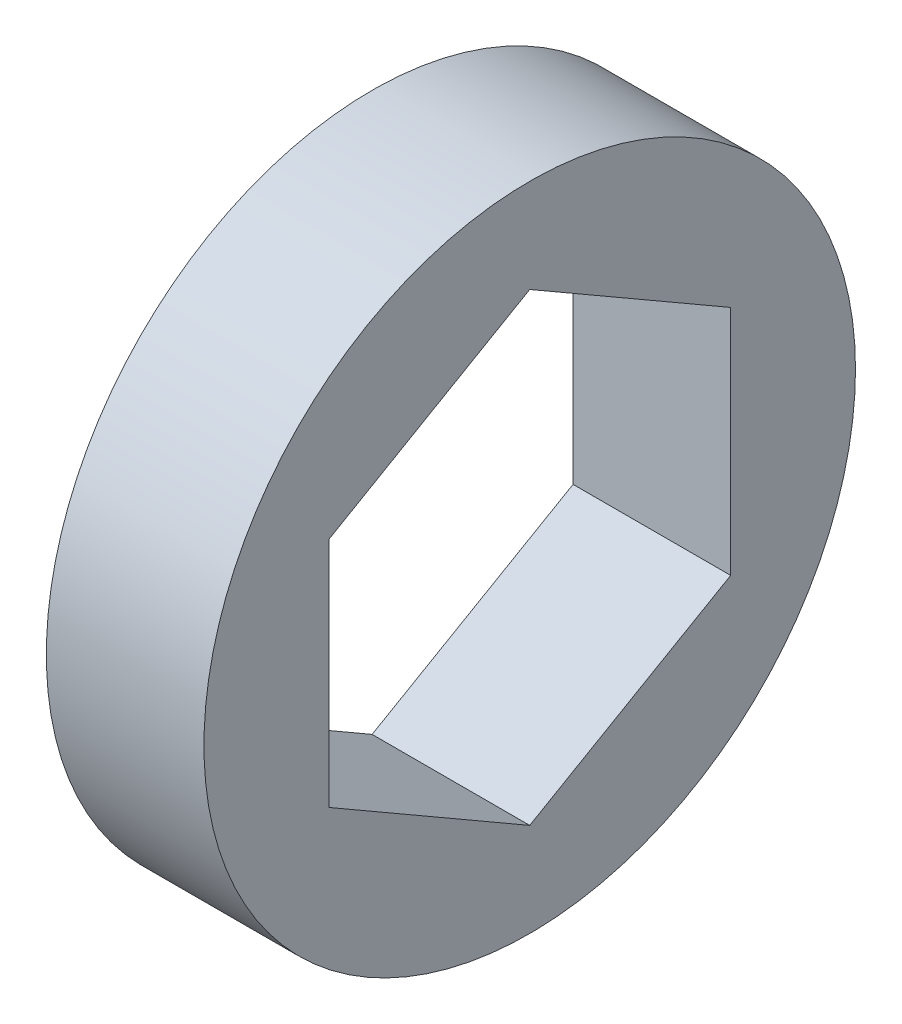
ISO-10303-21;
HEADER;
FILE_DESCRIPTION(('STEP AP214'),'2;1');
FILE_NAME('part.step','',(''),(''),'','','');
FILE_SCHEMA(('AUTOMOTIVE_DESIGN { 1 0 10303 214 1 1 1 1 }'));
ENDSEC;
DATA;
#1=APPLICATION_CONTEXT('core data for automotive mechanical design processes');
#2=APPLICATION_PROTOCOL_DEFINITION('international standard','automotive_design',2000,#1);
#3=PRODUCT_CONTEXT('',#1,'mechanical');
#4=PRODUCT('Part','Part','',(#3));
#5=PRODUCT_RELATED_PRODUCT_CATEGORY('part','',(#4));
#6=PRODUCT_DEFINITION_FORMATION('','',#4);
#7=PRODUCT_DEFINITION_CONTEXT('part definition',#1,'design');
#8=PRODUCT_DEFINITION('design','',#6,#7);
#9=PRODUCT_DEFINITION_SHAPE('','',#8);
#10=(LENGTH_UNIT() NAMED_UNIT(*) SI_UNIT(.MILLI.,.METRE.));
#11=(NAMED_UNIT(*) PLANE_ANGLE_UNIT() SI_UNIT($,.RADIAN.));
#12=(NAMED_UNIT(*) SI_UNIT($,.STERADIAN.) SOLID_ANGLE_UNIT());
#13=UNCERTAINTY_MEASURE_WITH_UNIT(LENGTH_MEASURE(1.E-05),#10,'distance_accuracy_value','');
#14=(GEOMETRIC_REPRESENTATION_CONTEXT(3) GLOBAL_UNCERTAINTY_ASSIGNED_CONTEXT((#13)) GLOBAL_UNIT_ASSIGNED_CONTEXT((#10,
#11,#12)) REPRESENTATION_CONTEXT('',''));
#15=CARTESIAN_POINT('',(0.,0.,0.));
#16=DIRECTION('',(0.,0.,1.));
#17=DIRECTION('',(1.,0.,0.));
#18=AXIS2_PLACEMENT_3D('',#15,#16,#17);
#19=CARTESIAN_POINT('',(5.08,0.,0.));
#20=DIRECTION('',(1.,0.,0.));
#21=DIRECTION('',(0.,0.,-1.));
#22=AXIS2_PLACEMENT_3D('',#19,#20,#21);
#23=PLANE('',#22);
#24=CARTESIAN_POINT('',(5.08,0.,0.));
#25=DIRECTION('',(1.,0.,0.));
#26=DIRECTION('',(0.,0.,-1.));
#27=AXIS2_PLACEMENT_3D('',#24,#25,#26);
#28=CIRCLE('',#27,10.5);
#29=CARTESIAN_POINT('',(5.08,0.,-10.5));
#30=VERTEX_POINT('',#29);
#31=EDGE_CURVE('E11',#30,#30,#28,.T.);
#32=ORIENTED_EDGE('',*,*,#31,.T.);
#33=EDGE_LOOP('',(#32));
#34=FACE_BOUND('',#33,.T.);
#35=DIRECTION('',(0.,-0.5,0.866025403784439));
#36=VECTOR('',#35,1.);
#37=CARTESIAN_POINT('',(5.08,7.47899538708242,0.));
#38=LINE('',#37,#36);
#39=CARTESIAN_POINT('',(5.08,7.47899538708242,0.));
#40=VERTEX_POINT('',#39);
#41=CARTESIAN_POINT('',(5.08,3.73949769354121,6.477));
#42=VERTEX_POINT('',#41);
#43=EDGE_CURVE('E94',#40,#42,#38,.T.);
#44=ORIENTED_EDGE('',*,*,#43,.F.);
#45=DIRECTION('',(0.,0.5,0.866025403784439));
#46=VECTOR('',#45,1.);
#47=CARTESIAN_POINT('',(5.08,3.73949769354121,-6.477));
#48=LINE('',#47,#46);
#49=CARTESIAN_POINT('',(5.08,3.73949769354121,-6.477));
#50=VERTEX_POINT('',#49);
#51=EDGE_CURVE('E86',#50,#40,#48,.T.);
#52=ORIENTED_EDGE('',*,*,#51,.F.);
#53=DIRECTION('',(0.,1.,0.));
#54=VECTOR('',#53,1.);
#55=CARTESIAN_POINT('',(5.08,-3.73949769354121,-6.477));
#56=LINE('',#55,#54);
#57=CARTESIAN_POINT('',(5.08,-3.73949769354121,-6.477));
#58=VERTEX_POINT('',#57);
#59=EDGE_CURVE('E114',#58,#50,#56,.T.);
#60=ORIENTED_EDGE('',*,*,#59,.F.);
#61=DIRECTION('',(0.,0.5,-0.866025403784439));
#62=VECTOR('',#61,1.);
#63=CARTESIAN_POINT('',(5.08,-7.47899538708241,0.));
#64=LINE('',#63,#62);
#65=CARTESIAN_POINT('',(5.08,-7.47899538708241,0.));
#66=VERTEX_POINT('',#65);
#67=EDGE_CURVE('E112',#66,#58,#64,.T.);
#68=ORIENTED_EDGE('',*,*,#67,.F.);
#69=DIRECTION('',(0.,-0.5,-0.866025403784439));
#70=VECTOR('',#69,1.);
#71=CARTESIAN_POINT('',(5.08,-3.7394976935412,6.477));
#72=LINE('',#71,#70);
#73=CARTESIAN_POINT('',(5.08,-3.7394976935412,6.477));
#74=VERTEX_POINT('',#73);
#75=EDGE_CURVE('E108',#74,#66,#72,.T.);
#76=ORIENTED_EDGE('',*,*,#75,.F.);
#77=DIRECTION('',(0.,-1.,0.));
#78=VECTOR('',#77,1.);
#79=CARTESIAN_POINT('',(5.08,3.73949769354121,6.477));
#80=LINE('',#79,#78);
#81=EDGE_CURVE('E106',#42,#74,#80,.T.);
#82=ORIENTED_EDGE('',*,*,#81,.F.);
#83=EDGE_LOOP('',(#44,#52,#60,#68,#76,#82));
#84=FACE_BOUND('',#83,.T.);
#85=ADVANCED_FACE('F33',(#34,#84),#23,.T.);
#86=CARTESIAN_POINT('',(0.,0.,0.));
#87=DIRECTION('',(1.,0.,0.));
#88=DIRECTION('',(0.,0.,-1.));
#89=AXIS2_PLACEMENT_3D('',#86,#87,#88);
#90=PLANE('',#89);
#91=CARTESIAN_POINT('',(0.,0.,0.));
#92=DIRECTION('',(1.,0.,0.));
#93=DIRECTION('',(0.,0.,-1.));
#94=AXIS2_PLACEMENT_3D('',#91,#92,#93);
#95=CIRCLE('',#94,10.5);
#96=CARTESIAN_POINT('',(0.,0.,-10.5));
#97=VERTEX_POINT('',#96);
#98=EDGE_CURVE('E37',#97,#97,#95,.T.);
#99=ORIENTED_EDGE('',*,*,#98,.F.);
#100=EDGE_LOOP('',(#99));
#101=FACE_BOUND('',#100,.T.);
#102=DIRECTION('',(0.,0.5,0.866025403784439));
#103=VECTOR('',#102,1.);
#104=CARTESIAN_POINT('',(0.,3.73949769354121,-6.477));
#105=LINE('',#104,#103);
#106=CARTESIAN_POINT('',(0.,3.73949769354121,-6.477));
#107=VERTEX_POINT('',#106);
#108=CARTESIAN_POINT('',(0.,7.47899538708242,0.));
#109=VERTEX_POINT('',#108);
#110=EDGE_CURVE('E56',#107,#109,#105,.T.);
#111=ORIENTED_EDGE('',*,*,#110,.T.);
#112=DIRECTION('',(0.,-0.5,0.866025403784439));
#113=VECTOR('',#112,1.);
#114=CARTESIAN_POINT('',(0.,7.47899538708242,0.));
#115=LINE('',#114,#113);
#116=CARTESIAN_POINT('',(0.,3.73949769354121,6.477));
#117=VERTEX_POINT('',#116);
#118=EDGE_CURVE('E101',#109,#117,#115,.T.);
#119=ORIENTED_EDGE('',*,*,#118,.T.);
#120=DIRECTION('',(0.,-1.,0.));
#121=VECTOR('',#120,1.);
#122=CARTESIAN_POINT('',(0.,3.73949769354121,6.477));
#123=LINE('',#122,#121);
#124=CARTESIAN_POINT('',(0.,-3.7394976935412,6.477));
#125=VERTEX_POINT('',#124);
#126=EDGE_CURVE('E118',#117,#125,#123,.T.);
#127=ORIENTED_EDGE('',*,*,#126,.T.);
#128=DIRECTION('',(0.,-0.5,-0.866025403784439));
#129=VECTOR('',#128,1.);
#130=CARTESIAN_POINT('',(0.,-3.7394976935412,6.477));
#131=LINE('',#130,#129);
#132=CARTESIAN_POINT('',(0.,-7.47899538708241,0.));
#133=VERTEX_POINT('',#132);
#134=EDGE_CURVE('E121',#125,#133,#131,.T.);
#135=ORIENTED_EDGE('',*,*,#134,.T.);
#136=DIRECTION('',(0.,0.5,-0.866025403784439));
#137=VECTOR('',#136,1.);
#138=CARTESIAN_POINT('',(0.,-7.47899538708241,0.));
#139=LINE('',#138,#137);
#140=CARTESIAN_POINT('',(0.,-3.73949769354121,-6.477));
#141=VERTEX_POINT('',#140);
#142=EDGE_CURVE('E124',#133,#141,#139,.T.);
#143=ORIENTED_EDGE('',*,*,#142,.T.);
#144=DIRECTION('',(0.,1.,0.));
#145=VECTOR('',#144,1.);
#146=CARTESIAN_POINT('',(0.,-3.73949769354121,-6.477));
#147=LINE('',#146,#145);
#148=EDGE_CURVE('E95',#141,#107,#147,.T.);
#149=ORIENTED_EDGE('',*,*,#148,.T.);
#150=EDGE_LOOP('',(#111,#119,#127,#135,#143,#149));
#151=FACE_BOUND('',#150,.T.);
#152=ADVANCED_FACE('F141',(#101,#151),#90,.F.);
#153=CARTESIAN_POINT('',(5.08,0.,0.));
#154=DIRECTION('',(-1.,0.,0.));
#155=DIRECTION('',(0.,0.,1.));
#156=AXIS2_PLACEMENT_3D('',#153,#154,#155);
#157=CYLINDRICAL_SURFACE('',#156,10.5);
#158=ORIENTED_EDGE('',*,*,#31,.F.);
#159=EDGE_LOOP('',(#158));
#160=FACE_BOUND('',#159,.T.);
#161=ORIENTED_EDGE('',*,*,#98,.T.);
#162=EDGE_LOOP('',(#161));
#163=FACE_BOUND('',#162,.T.);
#164=ADVANCED_FACE('F35',(#160,#163),#157,.T.);
#165=CARTESIAN_POINT('',(5.08,3.73949769354121,-6.477));
#166=DIRECTION('',(0.,-0.866025403784439,0.5));
#167=DIRECTION('',(0.,-0.5,-0.866025403784439));
#168=AXIS2_PLACEMENT_3D('',#165,#166,#167);
#169=PLANE('',#168);
#170=ORIENTED_EDGE('',*,*,#110,.F.);
#171=DIRECTION('',(-1.,0.,0.));
#172=VECTOR('',#171,1.);
#173=CARTESIAN_POINT('',(5.08,3.73949769354121,-6.477));
#174=LINE('',#173,#172);
#175=EDGE_CURVE('E90',#50,#107,#174,.T.);
#176=ORIENTED_EDGE('',*,*,#175,.F.);
#177=ORIENTED_EDGE('',*,*,#51,.T.);
#178=DIRECTION('',(-1.,0.,0.));
#179=VECTOR('',#178,1.);
#180=CARTESIAN_POINT('',(5.08,7.47899538708242,0.));
#181=LINE('',#180,#179);
#182=EDGE_CURVE('E89',#40,#109,#181,.T.);
#183=ORIENTED_EDGE('',*,*,#182,.T.);
#184=EDGE_LOOP('',(#170,#176,#177,#183));
#185=FACE_BOUND('',#184,.T.);
#186=ADVANCED_FACE('F88',(#185),#169,.T.);
#187=CARTESIAN_POINT('',(5.08,7.47899538708242,0.));
#188=DIRECTION('',(0.,-0.866025403784439,-0.5));
#189=DIRECTION('',(0.,0.5,-0.866025403784439));
#190=AXIS2_PLACEMENT_3D('',#187,#188,#189);
#191=PLANE('',#190);
#192=ORIENTED_EDGE('',*,*,#118,.F.);
#193=ORIENTED_EDGE('',*,*,#182,.F.);
#194=ORIENTED_EDGE('',*,*,#43,.T.);
#195=DIRECTION('',(-1.,0.,0.));
#196=VECTOR('',#195,1.);
#197=CARTESIAN_POINT('',(5.08,3.73949769354121,6.477));
#198=LINE('',#197,#196);
#199=EDGE_CURVE('E102',#42,#117,#198,.T.);
#200=ORIENTED_EDGE('',*,*,#199,.T.);
#201=EDGE_LOOP('',(#192,#193,#194,#200));
#202=FACE_BOUND('',#201,.T.);
#203=ADVANCED_FACE('F98',(#202),#191,.T.);
#204=CARTESIAN_POINT('',(5.08,3.73949769354121,6.477));
#205=DIRECTION('',(0.,0.,-1.));
#206=DIRECTION('',(-1.,0.,0.));
#207=AXIS2_PLACEMENT_3D('',#204,#205,#206);
#208=PLANE('',#207);
#209=ORIENTED_EDGE('',*,*,#126,.F.);
#210=ORIENTED_EDGE('',*,*,#199,.F.);
#211=ORIENTED_EDGE('',*,*,#81,.T.);
#212=DIRECTION('',(-1.,0.,0.));
#213=VECTOR('',#212,1.);
#214=CARTESIAN_POINT('',(5.08,-3.7394976935412,6.477));
#215=LINE('',#214,#213);
#216=EDGE_CURVE('E133',#74,#125,#215,.T.);
#217=ORIENTED_EDGE('',*,*,#216,.T.);
#218=EDGE_LOOP('',(#209,#210,#211,#217));
#219=FACE_BOUND('',#218,.T.);
#220=ADVANCED_FACE('F137',(#219),#208,.T.);
#221=CARTESIAN_POINT('',(5.08,-3.7394976935412,6.477));
#222=DIRECTION('',(0.,0.866025403784439,-0.5));
#223=DIRECTION('',(0.,0.5,0.866025403784439));
#224=AXIS2_PLACEMENT_3D('',#221,#222,#223);
#225=PLANE('',#224);
#226=ORIENTED_EDGE('',*,*,#134,.F.);
#227=ORIENTED_EDGE('',*,*,#216,.F.);
#228=ORIENTED_EDGE('',*,*,#75,.T.);
#229=DIRECTION('',(-1.,0.,0.));
#230=VECTOR('',#229,1.);
#231=CARTESIAN_POINT('',(5.08,-7.47899538708241,0.));
#232=LINE('',#231,#230);
#233=EDGE_CURVE('E131',#66,#133,#232,.T.);
#234=ORIENTED_EDGE('',*,*,#233,.T.);
#235=EDGE_LOOP('',(#226,#227,#228,#234));
#236=FACE_BOUND('',#235,.T.);
#237=ADVANCED_FACE('F149',(#236),#225,.T.);
#238=CARTESIAN_POINT('',(5.08,-7.47899538708241,0.));
#239=DIRECTION('',(0.,0.866025403784439,0.5));
#240=DIRECTION('',(0.,-0.5,0.866025403784439));
#241=AXIS2_PLACEMENT_3D('',#238,#239,#240);
#242=PLANE('',#241);
#243=ORIENTED_EDGE('',*,*,#142,.F.);
#244=ORIENTED_EDGE('',*,*,#233,.F.);
#245=ORIENTED_EDGE('',*,*,#67,.T.);
#246=DIRECTION('',(-1.,0.,0.));
#247=VECTOR('',#246,1.);
#248=CARTESIAN_POINT('',(5.08,-3.73949769354121,-6.477));
#249=LINE('',#248,#247);
#250=EDGE_CURVE('E48',#58,#141,#249,.T.);
#251=ORIENTED_EDGE('',*,*,#250,.T.);
#252=EDGE_LOOP('',(#243,#244,#245,#251));
#253=FACE_BOUND('',#252,.T.);
#254=ADVANCED_FACE('F147',(#253),#242,.T.);
#255=CARTESIAN_POINT('',(5.08,-3.73949769354121,-6.477));
#256=DIRECTION('',(0.,0.,1.));
#257=DIRECTION('',(0.,-1.,0.));
#258=AXIS2_PLACEMENT_3D('',#255,#256,#257);
#259=PLANE('',#258);
#260=ORIENTED_EDGE('',*,*,#148,.F.);
#261=ORIENTED_EDGE('',*,*,#250,.F.);
#262=ORIENTED_EDGE('',*,*,#59,.T.);
#263=ORIENTED_EDGE('',*,*,#175,.T.);
#264=EDGE_LOOP('',(#260,#261,#262,#263));
#265=FACE_BOUND('',#264,.T.);
#266=ADVANCED_FACE('F143',(#265),#259,.T.);
#267=CLOSED_SHELL('',(#85,#152,#164,#186,#203,#220,#237,#254,#266));
#268=MANIFOLD_SOLID_BREP('B2',#267);
#269=ADVANCED_BREP_SHAPE_REPRESENTATION('',(#18,#268),#14);
#270=SHAPE_DEFINITION_REPRESENTATION(#9,#269);
ENDSEC;
END-ISO-10303-21;
